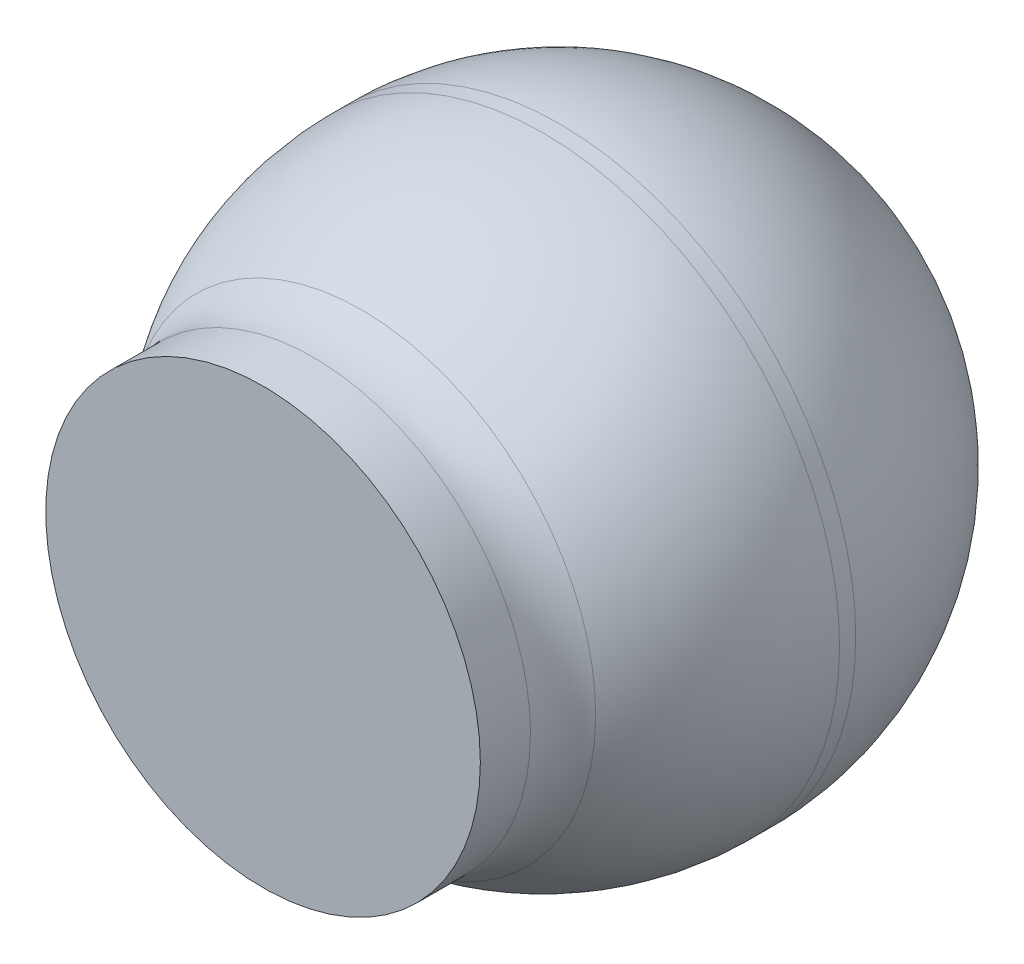
ISO-10303-21;
HEADER;
FILE_DESCRIPTION(('STEP AP214'),'2;1');
FILE_NAME('part.step','',(''),(''),'','','');
FILE_SCHEMA(('AUTOMOTIVE_DESIGN { 1 0 10303 214 1 1 1 1 }'));
ENDSEC;
DATA;
#1=APPLICATION_CONTEXT('core data for automotive mechanical design processes');
#2=APPLICATION_PROTOCOL_DEFINITION('international standard','automotive_design',2000,#1);
#3=PRODUCT_CONTEXT('',#1,'mechanical');
#4=PRODUCT('Part','Part','',(#3));
#5=PRODUCT_RELATED_PRODUCT_CATEGORY('part','',(#4));
#6=PRODUCT_DEFINITION_FORMATION('','',#4);
#7=PRODUCT_DEFINITION_CONTEXT('part definition',#1,'design');
#8=PRODUCT_DEFINITION('design','',#6,#7);
#9=PRODUCT_DEFINITION_SHAPE('','',#8);
#10=(LENGTH_UNIT() NAMED_UNIT(*) SI_UNIT(.MILLI.,.METRE.));
#11=(NAMED_UNIT(*) PLANE_ANGLE_UNIT() SI_UNIT($,.RADIAN.));
#12=(NAMED_UNIT(*) SI_UNIT($,.STERADIAN.) SOLID_ANGLE_UNIT());
#13=UNCERTAINTY_MEASURE_WITH_UNIT(LENGTH_MEASURE(1.E-05),#10,'distance_accuracy_value','');
#14=(GEOMETRIC_REPRESENTATION_CONTEXT(3) GLOBAL_UNCERTAINTY_ASSIGNED_CONTEXT((#13)) GLOBAL_UNIT_ASSIGNED_CONTEXT((#10,
#11,#12)) REPRESENTATION_CONTEXT('',''));
#15=CARTESIAN_POINT('',(0.,0.,0.));
#16=DIRECTION('',(0.,0.,1.));
#17=DIRECTION('',(1.,0.,0.));
#18=AXIS2_PLACEMENT_3D('',#15,#16,#17);
#19=CARTESIAN_POINT('',(1.977080077731,-9.131349291452,10.006534503384));
#20=DIRECTION('',(0.,0.,-1.));
#21=DIRECTION('',(-1.,0.,0.));
#22=AXIS2_PLACEMENT_3D('',#19,#20,#21);
#23=PLANE('',#22);
#24=CARTESIAN_POINT('',(1.977080077731,-9.131349291452,10.006534503384));
#25=DIRECTION('',(0.,0.,1.));
#26=DIRECTION('',(1.,0.,0.));
#27=AXIS2_PLACEMENT_3D('',#24,#25,#26);
#28=CIRCLE('',#27,0.275);
#29=CARTESIAN_POINT('',(2.252080077731,-9.131349291452,10.006534503384));
#30=VERTEX_POINT('',#29);
#31=EDGE_CURVE('E20',#30,#30,#28,.F.);
#32=ORIENTED_EDGE('',*,*,#31,.F.);
#33=EDGE_LOOP('',(#32));
#34=FACE_BOUND('',#33,.T.);
#35=ADVANCED_FACE('F17',(#34),#23,.F.);
#36=CARTESIAN_POINT('',(1.977080077731,-9.131349291452,9.906534503384));
#37=DIRECTION('',(0.,0.,1.));
#38=DIRECTION('',(1.,0.,0.));
#39=AXIS2_PLACEMENT_3D('',#36,#37,#38);
#40=CYLINDRICAL_SURFACE('',#39,0.275);
#41=CARTESIAN_POINT('',(1.977080077731,-9.131349291452,9.943180457728));
#42=DIRECTION('',(0.,0.,-1.));
#43=DIRECTION('',(0.996700902337582,0.081162252799247,0.));
#44=AXIS2_PLACEMENT_3D('',#41,#42,#43);
#45=CIRCLE('',#44,0.275);
#46=CARTESIAN_POINT('',(2.25117282587384,-9.10902967193221,9.943180457728));
#47=VERTEX_POINT('',#46);
#48=EDGE_CURVE('E65',#47,#47,#45,.F.);
#49=ORIENTED_EDGE('',*,*,#48,.T.);
#50=EDGE_LOOP('',(#49));
#51=FACE_BOUND('',#50,.T.);
#52=ORIENTED_EDGE('',*,*,#31,.T.);
#53=EDGE_LOOP('',(#52));
#54=FACE_BOUND('',#53,.T.);
#55=ADVANCED_FACE('F62',(#51,#54),#40,.T.);
#56=CARTESIAN_POINT('',(1.977080077731,-9.131349291452,9.943180457728));
#57=DIRECTION('',(0.,0.,-1.));
#58=DIRECTION('',(0.996700902337583,0.0811622527992448,0.));
#59=AXIS2_PLACEMENT_3D('',#56,#57,#58);
#60=TOROIDAL_SURFACE('',#59,0.375,0.1);
#61=ORIENTED_EDGE('',*,*,#48,.F.);
#62=EDGE_LOOP('',(#61));
#63=FACE_BOUND('',#62,.T.);
#64=CARTESIAN_POINT('',(1.977080077731,-9.131349291452,9.881744931236));
#65=DIRECTION('',(0.,0.,-1.));
#66=DIRECTION('',(-0.996700902337597,-0.0811622527990622,0.));
#67=AXIS2_PLACEMENT_3D('',#64,#65,#66);
#68=CIRCLE('',#67,0.296097046412665);
#69=CARTESIAN_POINT('',(1.681959884392,-9.155381194786,9.881744931236));
#70=VERTEX_POINT('',#69);
#71=EDGE_CURVE('E39',#70,#70,#68,.T.);
#72=ORIENTED_EDGE('',*,*,#71,.F.);
#73=EDGE_LOOP('',(#72));
#74=FACE_BOUND('',#73,.T.);
#75=ADVANCED_FACE('F57',(#63,#74),#60,.F.);
#76=CARTESIAN_POINT('',(1.603317239355,-9.161785136252,9.651976062157));
#77=CARTESIAN_POINT('',(1.603317239355,-9.161785136252,9.701461392103));
#78=CARTESIAN_POINT('',(1.611473782652,-9.161120941579,9.750947004335));
#79=CARTESIAN_POINT('',(1.627792914651,-9.159792059952,9.798626332798));
#80=CARTESIAN_POINT('',(1.651658609162,-9.157848654938,9.842699544317));
#81=CARTESIAN_POINT('',(1.681959884392,-9.155381194786,9.881744931236));
#82=(BOUNDED_CURVE() B_SPLINE_CURVE(5,(#76,#77,#78,#79,#80,#81),.UNSPECIFIED.,.F.,
.F.) B_SPLINE_CURVE_WITH_KNOTS((6,6),(0.,0.661568582165),
.UNSPECIFIED.) CURVE() GEOMETRIC_REPRESENTATION_ITEM() RATIONAL_B_SPLINE_CURVE((1.,1.,1.,1.,1.,1.)) REPRESENTATION_ITEM(''));
#83=CARTESIAN_POINT('',(1.977080077731,-9.131349291452,9.651976062157));
#84=DIRECTION('',(0.,0.,-1.));
#85=AXIS1_PLACEMENT('',#83,#84);
#86=SURFACE_OF_REVOLUTION('',#82,#85);
#87=CARTESIAN_POINT('',(1.977080077731,-9.131349291452,9.651976062157));
#88=DIRECTION('',(0.,0.,1.));
#89=DIRECTION('',(1.,0.,0.));
#90=AXIS2_PLACEMENT_3D('',#87,#88,#89);
#91=CIRCLE('',#90,0.375);
#92=CARTESIAN_POINT('',(2.352080077731,-9.131349291452,9.651976062157));
#93=VERTEX_POINT('',#92);
#94=EDGE_CURVE('E36',#93,#93,#91,.F.);
#95=ORIENTED_EDGE('',*,*,#94,.F.);
#96=EDGE_LOOP('',(#95));
#97=FACE_BOUND('',#96,.T.);
#98=ORIENTED_EDGE('',*,*,#71,.T.);
#99=EDGE_LOOP('',(#98));
#100=FACE_BOUND('',#99,.T.);
#101=ADVANCED_FACE('F53',(#97,#100),#86,.F.);
#102=CARTESIAN_POINT('',(1.977080077731,-9.131349291452,9.256534503384));
#103=DIRECTION('',(0.,0.,1.));
#104=DIRECTION('',(1.,0.,0.));
#105=AXIS2_PLACEMENT_3D('',#102,#103,#104);
#106=CYLINDRICAL_SURFACE('',#105,0.375);
#107=CARTESIAN_POINT('',(1.977080077731,-9.131349291452,9.631534503384));
#108=DIRECTION('',(0.,0.,-1.));
#109=DIRECTION('',(0.0811622527992357,-0.996700902337583,0.));
#110=AXIS2_PLACEMENT_3D('',#107,#108,#109);
#111=CIRCLE('',#110,0.375);
#112=CARTESIAN_POINT('',(2.00751592253071,-9.50511212982859,9.631534503384));
#113=VERTEX_POINT('',#112);
#114=CARTESIAN_POINT('',(1.94664423293129,-8.75758645307541,9.631534503384));
#115=VERTEX_POINT('',#114);
#116=EDGE_CURVE('E11',#113,#115,#111,.T.);
#117=ORIENTED_EDGE('',*,*,#116,.F.);
#118=CARTESIAN_POINT('',(1.977080077731,-9.131349291452,9.631534503384));
#119=DIRECTION('',(0.,0.,1.));
#120=DIRECTION('',(0.0811622527992365,-0.996700902337583,0.));
#121=AXIS2_PLACEMENT_3D('',#118,#119,#120);
#122=CIRCLE('',#121,0.375);
#123=EDGE_CURVE('E25',#115,#113,#122,.F.);
#124=ORIENTED_EDGE('',*,*,#123,.F.);
#125=EDGE_LOOP('',(#117,#124));
#126=FACE_BOUND('',#125,.T.);
#127=ORIENTED_EDGE('',*,*,#94,.T.);
#128=EDGE_LOOP('',(#127));
#129=FACE_BOUND('',#128,.T.);
#130=ADVANCED_FACE('F34',(#126,#129),#106,.T.);
#131=CARTESIAN_POINT('',(1.977080077731,-9.131349291452,9.631534503384));
#132=DIRECTION('',(0.0811622527992361,-0.996700902337583,0.));
#133=DIRECTION('',(-0.996700902337583,-0.0811622527992361,0.));
#134=AXIS2_PLACEMENT_3D('',#131,#132,#133);
#135=SPHERICAL_SURFACE('',#134,0.375);
#136=ORIENTED_EDGE('',*,*,#123,.T.);
#137=ORIENTED_EDGE('',*,*,#116,.T.);
#138=EDGE_LOOP('',(#136,#137));
#139=FACE_BOUND('',#138,.T.);
#140=ADVANCED_FACE('F32',(#139),#135,.T.);
#141=CLOSED_SHELL('',(#35,#55,#75,#101,#130,#140));
#142=MANIFOLD_SOLID_BREP('B1',#141);
#143=ADVANCED_BREP_SHAPE_REPRESENTATION('',(#18,#142),#14);
#144=SHAPE_DEFINITION_REPRESENTATION(#9,#143);
ENDSEC;
END-ISO-10303-21;
